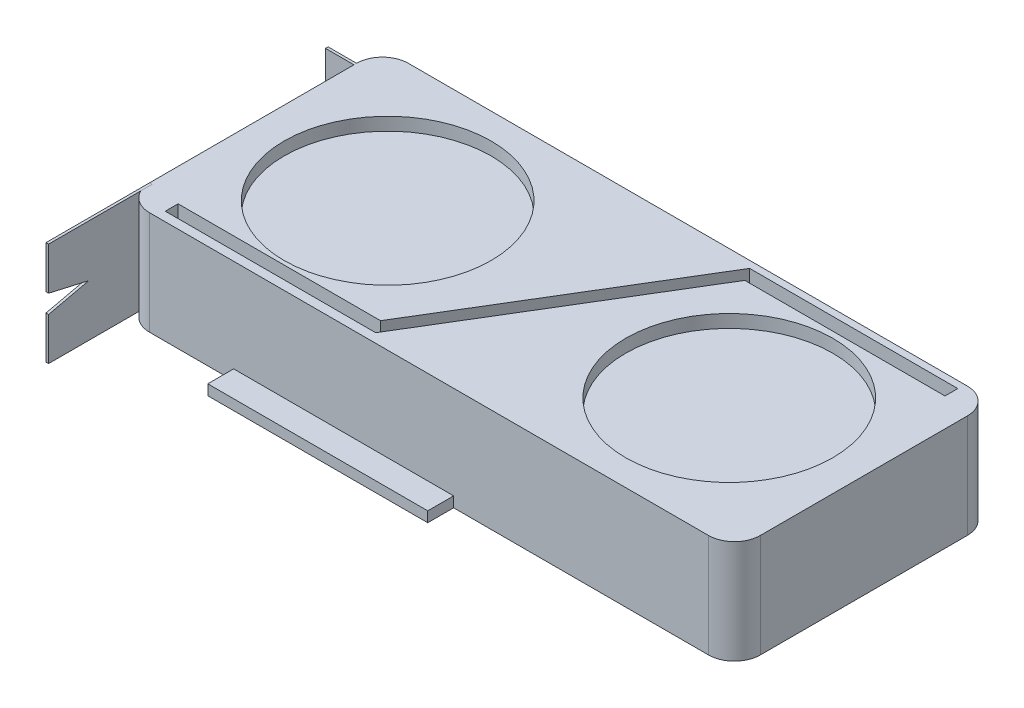
ISO-10303-21;
HEADER;
FILE_DESCRIPTION(('STEP AP214'),'2;1');
FILE_NAME('part.step','',(''),(''),'','','');
FILE_SCHEMA(('AUTOMOTIVE_DESIGN { 1 0 10303 214 1 1 1 1 }'));
ENDSEC;
DATA;
#1=APPLICATION_CONTEXT('core data for automotive mechanical design processes');
#2=APPLICATION_PROTOCOL_DEFINITION('international standard','automotive_design',2000,#1);
#3=PRODUCT_CONTEXT('',#1,'mechanical');
#4=PRODUCT('Part','Part','',(#3));
#5=PRODUCT_RELATED_PRODUCT_CATEGORY('part','',(#4));
#6=PRODUCT_DEFINITION_FORMATION('','',#4);
#7=PRODUCT_DEFINITION_CONTEXT('part definition',#1,'design');
#8=PRODUCT_DEFINITION('design','',#6,#7);
#9=PRODUCT_DEFINITION_SHAPE('','',#8);
#10=(LENGTH_UNIT() NAMED_UNIT(*) SI_UNIT(.MILLI.,.METRE.));
#11=(NAMED_UNIT(*) PLANE_ANGLE_UNIT() SI_UNIT($,.RADIAN.));
#12=(NAMED_UNIT(*) SI_UNIT($,.STERADIAN.) SOLID_ANGLE_UNIT());
#13=UNCERTAINTY_MEASURE_WITH_UNIT(LENGTH_MEASURE(1.E-05),#10,'distance_accuracy_value','');
#14=(GEOMETRIC_REPRESENTATION_CONTEXT(3) GLOBAL_UNCERTAINTY_ASSIGNED_CONTEXT((#13)) GLOBAL_UNIT_ASSIGNED_CONTEXT((#10,
#11,#12)) REPRESENTATION_CONTEXT('',''));
#15=CARTESIAN_POINT('',(0.,0.,0.));
#16=DIRECTION('',(0.,0.,1.));
#17=DIRECTION('',(1.,0.,0.));
#18=AXIS2_PLACEMENT_3D('',#15,#16,#17);
#19=CARTESIAN_POINT('',(-117.,40.,40.));
#20=DIRECTION('',(0.,0.,-1.));
#21=DIRECTION('',(-1.,0.,0.));
#22=AXIS2_PLACEMENT_3D('',#19,#20,#21);
#23=PLANE('',#22);
#24=DIRECTION('',(0.,-1.,0.));
#25=VECTOR('',#24,1.);
#26=CARTESIAN_POINT('',(-118.,40.,40.));
#27=LINE('',#26,#25);
#28=CARTESIAN_POINT('',(-118.,40.,40.));
#29=VERTEX_POINT('',#28);
#30=CARTESIAN_POINT('',(-118.,0.,40.));
#31=VERTEX_POINT('',#30);
#32=EDGE_CURVE('E144',#29,#31,#27,.T.);
#33=ORIENTED_EDGE('',*,*,#32,.F.);
#34=DIRECTION('',(-1.,0.,0.));
#35=VECTOR('',#34,1.);
#36=CARTESIAN_POINT('',(-117.,40.,40.));
#37=LINE('',#36,#35);
#38=CARTESIAN_POINT('',(-117.,40.,40.));
#39=VERTEX_POINT('',#38);
#40=EDGE_CURVE('E12',#39,#29,#37,.T.);
#41=ORIENTED_EDGE('',*,*,#40,.F.);
#42=DIRECTION('',(0.,-1.,0.));
#43=VECTOR('',#42,1.);
#44=CARTESIAN_POINT('',(-117.,40.,40.));
#45=LINE('',#44,#43);
#46=CARTESIAN_POINT('',(-117.,0.,40.));
#47=VERTEX_POINT('',#46);
#48=EDGE_CURVE('E161',#39,#47,#45,.T.);
#49=ORIENTED_EDGE('',*,*,#48,.T.);
#50=DIRECTION('',(-1.,0.,0.));
#51=VECTOR('',#50,1.);
#52=CARTESIAN_POINT('',(-117.,0.,40.));
#53=LINE('',#52,#51);
#54=EDGE_CURVE('E56',#47,#31,#53,.T.);
#55=ORIENTED_EDGE('',*,*,#54,.T.);
#56=EDGE_LOOP('',(#33,#41,#49,#55));
#57=FACE_BOUND('',#56,.T.);
#58=ADVANCED_FACE('F53',(#57),#23,.T.);
#59=CARTESIAN_POINT('',(-117.,40.,40.));
#60=DIRECTION('',(0.,1.,0.));
#61=DIRECTION('',(0.,0.,1.));
#62=AXIS2_PLACEMENT_3D('',#59,#60,#61);
#63=PLANE('',#62);
#64=DIRECTION('',(0.,0.,-1.));
#65=VECTOR('',#64,1.);
#66=CARTESIAN_POINT('',(-118.,40.,40.));
#67=LINE('',#66,#65);
#68=CARTESIAN_POINT('',(-118.,40.,80.));
#69=VERTEX_POINT('',#68);
#70=EDGE_CURVE('E159',#69,#29,#67,.T.);
#71=ORIENTED_EDGE('',*,*,#70,.F.);
#72=DIRECTION('',(-1.,0.,0.));
#73=VECTOR('',#72,1.);
#74=CARTESIAN_POINT('',(-117.,40.,80.));
#75=LINE('',#74,#73);
#76=CARTESIAN_POINT('',(-117.,40.,80.));
#77=VERTEX_POINT('',#76);
#78=EDGE_CURVE('E62',#77,#69,#75,.T.);
#79=ORIENTED_EDGE('',*,*,#78,.F.);
#80=DIRECTION('',(0.,0.,-1.));
#81=VECTOR('',#80,1.);
#82=CARTESIAN_POINT('',(-117.,40.,40.));
#83=LINE('',#82,#81);
#84=EDGE_CURVE('E134',#77,#39,#83,.T.);
#85=ORIENTED_EDGE('',*,*,#84,.T.);
#86=ORIENTED_EDGE('',*,*,#40,.T.);
#87=EDGE_LOOP('',(#71,#79,#85,#86));
#88=FACE_BOUND('',#87,.T.);
#89=ADVANCED_FACE('F171',(#88),#63,.T.);
#90=CARTESIAN_POINT('',(-117.,40.,80.));
#91=DIRECTION('',(0.,0.,1.));
#92=DIRECTION('',(1.,0.,0.));
#93=AXIS2_PLACEMENT_3D('',#90,#91,#92);
#94=PLANE('',#93);
#95=DIRECTION('',(0.,1.,0.));
#96=VECTOR('',#95,1.);
#97=CARTESIAN_POINT('',(-118.,40.,80.));
#98=LINE('',#97,#96);
#99=CARTESIAN_POINT('',(-118.,23.5437675618981,80.));
#100=VERTEX_POINT('',#99);
#101=EDGE_CURVE('E121',#100,#69,#98,.T.);
#102=ORIENTED_EDGE('',*,*,#101,.F.);
#103=DIRECTION('',(-1.,0.,0.));
#104=VECTOR('',#103,1.);
#105=CARTESIAN_POINT('',(-117.,23.5437675618981,80.));
#106=LINE('',#105,#104);
#107=CARTESIAN_POINT('',(-117.,23.5437675618981,80.));
#108=VERTEX_POINT('',#107);
#109=EDGE_CURVE('E116',#108,#100,#106,.T.);
#110=ORIENTED_EDGE('',*,*,#109,.F.);
#111=DIRECTION('',(0.,1.,0.));
#112=VECTOR('',#111,1.);
#113=CARTESIAN_POINT('',(-117.,40.,80.));
#114=LINE('',#113,#112);
#115=EDGE_CURVE('E119',#108,#77,#114,.T.);
#116=ORIENTED_EDGE('',*,*,#115,.T.);
#117=ORIENTED_EDGE('',*,*,#78,.T.);
#118=EDGE_LOOP('',(#102,#110,#116,#117));
#119=FACE_BOUND('',#118,.T.);
#120=ADVANCED_FACE('F118',(#119),#94,.T.);
#121=CARTESIAN_POINT('',(-117.,23.5437675618981,80.));
#122=DIRECTION('',(0.,-0.97495584306695,0.22239852533147));
#123=DIRECTION('',(0.,-0.22239852533147,-0.97495584306695));
#124=AXIS2_PLACEMENT_3D('',#121,#122,#123);
#125=PLANE('',#124);
#126=DIRECTION('',(0.,0.22239852533147,0.97495584306695));
#127=VECTOR('',#126,1.);
#128=CARTESIAN_POINT('',(-118.,23.5437675618981,80.));
#129=LINE('',#128,#127);
#130=CARTESIAN_POINT('',(-118.,20.,64.4647490994188));
#131=VERTEX_POINT('',#130);
#132=EDGE_CURVE('E156',#131,#100,#129,.T.);
#133=ORIENTED_EDGE('',*,*,#132,.F.);
#134=DIRECTION('',(-1.,0.,0.));
#135=VECTOR('',#134,1.);
#136=CARTESIAN_POINT('',(-117.,20.,64.4647490994188));
#137=LINE('',#136,#135);
#138=CARTESIAN_POINT('',(-117.,20.,64.4647490994188));
#139=VERTEX_POINT('',#138);
#140=EDGE_CURVE('E126',#139,#131,#137,.T.);
#141=ORIENTED_EDGE('',*,*,#140,.F.);
#142=DIRECTION('',(0.,0.22239852533147,0.97495584306695));
#143=VECTOR('',#142,1.);
#144=CARTESIAN_POINT('',(-117.,23.5437675618981,80.));
#145=LINE('',#144,#143);
#146=EDGE_CURVE('E132',#139,#108,#145,.T.);
#147=ORIENTED_EDGE('',*,*,#146,.T.);
#148=ORIENTED_EDGE('',*,*,#109,.T.);
#149=EDGE_LOOP('',(#133,#141,#147,#148));
#150=FACE_BOUND('',#149,.T.);
#151=ADVANCED_FACE('F136',(#150),#125,.T.);
#152=CARTESIAN_POINT('',(-117.,16.4562324381019,80.));
#153=DIRECTION('',(0.,0.97495584306695,0.22239852533147));
#154=DIRECTION('',(0.,-0.22239852533147,0.97495584306695));
#155=AXIS2_PLACEMENT_3D('',#152,#153,#154);
#156=PLANE('',#155);
#157=DIRECTION('',(0.,0.22239852533147,-0.97495584306695));
#158=VECTOR('',#157,1.);
#159=CARTESIAN_POINT('',(-118.,16.4562324381019,80.));
#160=LINE('',#159,#158);
#161=CARTESIAN_POINT('',(-118.,16.4562324381019,80.));
#162=VERTEX_POINT('',#161);
#163=EDGE_CURVE('E153',#162,#131,#160,.T.);
#164=ORIENTED_EDGE('',*,*,#163,.F.);
#165=DIRECTION('',(-1.,0.,0.));
#166=VECTOR('',#165,1.);
#167=CARTESIAN_POINT('',(-117.,16.4562324381019,80.));
#168=LINE('',#167,#166);
#169=CARTESIAN_POINT('',(-117.,16.4562324381019,80.));
#170=VERTEX_POINT('',#169);
#171=EDGE_CURVE('E165',#170,#162,#168,.T.);
#172=ORIENTED_EDGE('',*,*,#171,.F.);
#173=DIRECTION('',(0.,0.22239852533147,-0.97495584306695));
#174=VECTOR('',#173,1.);
#175=CARTESIAN_POINT('',(-117.,16.4562324381019,80.));
#176=LINE('',#175,#174);
#177=EDGE_CURVE('E137',#170,#139,#176,.T.);
#178=ORIENTED_EDGE('',*,*,#177,.T.);
#179=ORIENTED_EDGE('',*,*,#140,.T.);
#180=EDGE_LOOP('',(#164,#172,#178,#179));
#181=FACE_BOUND('',#180,.T.);
#182=ADVANCED_FACE('F184',(#181),#156,.T.);
#183=CARTESIAN_POINT('',(-117.,0.,80.));
#184=DIRECTION('',(0.,0.,1.));
#185=DIRECTION('',(1.,0.,0.));
#186=AXIS2_PLACEMENT_3D('',#183,#184,#185);
#187=PLANE('',#186);
#188=DIRECTION('',(0.,1.,0.));
#189=VECTOR('',#188,1.);
#190=CARTESIAN_POINT('',(-118.,0.,80.));
#191=LINE('',#190,#189);
#192=CARTESIAN_POINT('',(-118.,0.,80.));
#193=VERTEX_POINT('',#192);
#194=EDGE_CURVE('E150',#193,#162,#191,.T.);
#195=ORIENTED_EDGE('',*,*,#194,.F.);
#196=DIRECTION('',(-1.,0.,0.));
#197=VECTOR('',#196,1.);
#198=CARTESIAN_POINT('',(-117.,0.,80.));
#199=LINE('',#198,#197);
#200=CARTESIAN_POINT('',(-117.,0.,80.));
#201=VERTEX_POINT('',#200);
#202=EDGE_CURVE('E166',#201,#193,#199,.T.);
#203=ORIENTED_EDGE('',*,*,#202,.F.);
#204=DIRECTION('',(0.,1.,0.));
#205=VECTOR('',#204,1.);
#206=CARTESIAN_POINT('',(-117.,0.,80.));
#207=LINE('',#206,#205);
#208=EDGE_CURVE('E139',#201,#170,#207,.T.);
#209=ORIENTED_EDGE('',*,*,#208,.T.);
#210=ORIENTED_EDGE('',*,*,#171,.T.);
#211=EDGE_LOOP('',(#195,#203,#209,#210));
#212=FACE_BOUND('',#211,.T.);
#213=ADVANCED_FACE('F187',(#212),#187,.T.);
#214=CARTESIAN_POINT('',(-117.,0.,40.));
#215=DIRECTION('',(0.,-1.,0.));
#216=DIRECTION('',(0.,0.,-1.));
#217=AXIS2_PLACEMENT_3D('',#214,#215,#216);
#218=PLANE('',#217);
#219=DIRECTION('',(0.,0.,1.));
#220=VECTOR('',#219,1.);
#221=CARTESIAN_POINT('',(-118.,0.,40.));
#222=LINE('',#221,#220);
#223=EDGE_CURVE('E147',#31,#193,#222,.T.);
#224=ORIENTED_EDGE('',*,*,#223,.F.);
#225=ORIENTED_EDGE('',*,*,#54,.F.);
#226=DIRECTION('',(0.,0.,1.));
#227=VECTOR('',#226,1.);
#228=CARTESIAN_POINT('',(-117.,0.,40.));
#229=LINE('',#228,#227);
#230=EDGE_CURVE('E267',#47,#201,#229,.T.);
#231=ORIENTED_EDGE('',*,*,#230,.T.);
#232=ORIENTED_EDGE('',*,*,#202,.T.);
#233=EDGE_LOOP('',(#224,#225,#231,#232));
#234=FACE_BOUND('',#233,.T.);
#235=ADVANCED_FACE('F168',(#234),#218,.T.);
#236=CARTESIAN_POINT('',(-117.,0.,0.));
#237=DIRECTION('',(-1.,0.,0.));
#238=DIRECTION('',(0.,0.,1.));
#239=AXIS2_PLACEMENT_3D('',#236,#237,#238);
#240=PLANE('',#239);
#241=ORIENTED_EDGE('',*,*,#48,.F.);
#242=ORIENTED_EDGE('',*,*,#84,.F.);
#243=ORIENTED_EDGE('',*,*,#115,.F.);
#244=ORIENTED_EDGE('',*,*,#146,.F.);
#245=ORIENTED_EDGE('',*,*,#177,.F.);
#246=ORIENTED_EDGE('',*,*,#208,.F.);
#247=ORIENTED_EDGE('',*,*,#230,.F.);
#248=EDGE_LOOP('',(#241,#242,#243,#244,#245,#246,#247));
#249=FACE_BOUND('',#248,.T.);
#250=ADVANCED_FACE('F130',(#249),#240,.F.);
#251=CARTESIAN_POINT('',(-118.,0.,0.));
#252=DIRECTION('',(-1.,0.,0.));
#253=DIRECTION('',(0.,0.,1.));
#254=AXIS2_PLACEMENT_3D('',#251,#252,#253);
#255=PLANE('',#254);
#256=ORIENTED_EDGE('',*,*,#32,.T.);
#257=ORIENTED_EDGE('',*,*,#223,.T.);
#258=ORIENTED_EDGE('',*,*,#194,.T.);
#259=ORIENTED_EDGE('',*,*,#163,.T.);
#260=ORIENTED_EDGE('',*,*,#132,.T.);
#261=ORIENTED_EDGE('',*,*,#101,.T.);
#262=ORIENTED_EDGE('',*,*,#70,.T.);
#263=EDGE_LOOP('',(#256,#257,#258,#259,#260,#261,#262));
#264=FACE_BOUND('',#263,.T.);
#265=ADVANCED_FACE('F170',(#264),#255,.T.);
#266=CLOSED_SHELL('',(#58,#89,#120,#151,#182,#213,#235,#250,#265));
#267=MANIFOLD_SOLID_BREP('B2',#266);
#268=CARTESIAN_POINT('',(-118.,40.,-50.));
#269=DIRECTION('',(1.,0.,0.));
#270=DIRECTION('',(0.,0.,-1.));
#271=AXIS2_PLACEMENT_3D('',#268,#269,#270);
#272=PLANE('',#271);
#273=DIRECTION('',(0.,1.,0.));
#274=VECTOR('',#273,1.);
#275=CARTESIAN_POINT('',(-118.,40.,-39.));
#276=LINE('',#275,#274);
#277=CARTESIAN_POINT('',(-118.,0.,-39.));
#278=VERTEX_POINT('',#277);
#279=CARTESIAN_POINT('',(-118.,40.,-39.));
#280=VERTEX_POINT('',#279);
#281=EDGE_CURVE('E292',#278,#280,#276,.T.);
#282=ORIENTED_EDGE('',*,*,#281,.F.);
#283=DIRECTION('',(0.,0.,1.));
#284=VECTOR('',#283,1.);
#285=CARTESIAN_POINT('',(-118.,0.,-50.));
#286=LINE('',#285,#284);
#287=CARTESIAN_POINT('',(-118.,0.,40.));
#288=VERTEX_POINT('',#287);
#289=EDGE_CURVE('E628',#278,#288,#286,.T.);
#290=ORIENTED_EDGE('',*,*,#289,.T.);
#291=DIRECTION('',(0.,-1.,0.));
#292=VECTOR('',#291,1.);
#293=CARTESIAN_POINT('',(-118.,40.,40.));
#294=LINE('',#293,#292);
#295=CARTESIAN_POINT('',(-118.,40.,40.));
#296=VERTEX_POINT('',#295);
#297=EDGE_CURVE('E51',#288,#296,#294,.F.);
#298=ORIENTED_EDGE('',*,*,#297,.T.);
#299=DIRECTION('',(0.,0.,1.));
#300=VECTOR('',#299,1.);
#301=CARTESIAN_POINT('',(-118.,40.,-50.));
#302=LINE('',#301,#300);
#303=EDGE_CURVE('E288',#280,#296,#302,.T.);
#304=ORIENTED_EDGE('',*,*,#303,.F.);
#305=EDGE_LOOP('',(#282,#290,#298,#304));
#306=FACE_BOUND('',#305,.T.);
#307=ADVANCED_FACE('F273',(#306),#272,.F.);
#308=CARTESIAN_POINT('',(-118.,40.,50.));
#309=DIRECTION('',(0.,0.,-1.));
#310=DIRECTION('',(-1.,0.,0.));
#311=AXIS2_PLACEMENT_3D('',#308,#309,#310);
#312=PLANE('',#311);
#313=DIRECTION('',(0.,-1.,0.));
#314=VECTOR('',#313,1.);
#315=CARTESIAN_POINT('',(-75.5,0.,50.));
#316=LINE('',#315,#314);
#317=CARTESIAN_POINT('',(-75.5,4.,50.));
#318=VERTEX_POINT('',#317);
#319=CARTESIAN_POINT('',(-75.5,0.,50.));
#320=VERTEX_POINT('',#319);
#321=EDGE_CURVE('E453',#318,#320,#316,.T.);
#322=ORIENTED_EDGE('',*,*,#321,.F.);
#323=DIRECTION('',(-1.,0.,0.));
#324=VECTOR('',#323,1.);
#325=CARTESIAN_POINT('',(-75.5,4.,50.));
#326=LINE('',#325,#324);
#327=CARTESIAN_POINT('',(9.50000000000002,3.99999999999999,50.));
#328=VERTEX_POINT('',#327);
#329=EDGE_CURVE('E469',#328,#318,#326,.T.);
#330=ORIENTED_EDGE('',*,*,#329,.F.);
#331=DIRECTION('',(0.,1.,0.));
#332=VECTOR('',#331,1.);
#333=CARTESIAN_POINT('',(9.50000000000002,0.,50.));
#334=LINE('',#333,#332);
#335=CARTESIAN_POINT('',(9.50000000000002,0.,50.));
#336=VERTEX_POINT('',#335);
#337=EDGE_CURVE('E458',#336,#328,#334,.T.);
#338=ORIENTED_EDGE('',*,*,#337,.F.);
#339=DIRECTION('',(1.,0.,0.));
#340=VECTOR('',#339,1.);
#341=CARTESIAN_POINT('',(-118.,0.,50.));
#342=LINE('',#341,#340);
#343=CARTESIAN_POINT('',(108.,0.,50.));
#344=VERTEX_POINT('',#343);
#345=EDGE_CURVE('E631',#336,#344,#342,.T.);
#346=ORIENTED_EDGE('',*,*,#345,.T.);
#347=DIRECTION('',(0.,-1.,0.));
#348=VECTOR('',#347,1.);
#349=CARTESIAN_POINT('',(108.,40.,50.));
#350=LINE('',#349,#348);
#351=CARTESIAN_POINT('',(108.,40.,50.));
#352=VERTEX_POINT('',#351);
#353=EDGE_CURVE('E658',#344,#352,#350,.F.);
#354=ORIENTED_EDGE('',*,*,#353,.T.);
#355=DIRECTION('',(1.,0.,0.));
#356=VECTOR('',#355,1.);
#357=CARTESIAN_POINT('',(-118.,40.,50.));
#358=LINE('',#357,#356);
#359=CARTESIAN_POINT('',(-108.,40.,50.));
#360=VERTEX_POINT('',#359);
#361=EDGE_CURVE('E616',#360,#352,#358,.T.);
#362=ORIENTED_EDGE('',*,*,#361,.F.);
#363=DIRECTION('',(0.,-1.,0.));
#364=VECTOR('',#363,1.);
#365=CARTESIAN_POINT('',(-108.,40.,50.));
#366=LINE('',#365,#364);
#367=CARTESIAN_POINT('',(-108.,0.,50.));
#368=VERTEX_POINT('',#367);
#369=EDGE_CURVE('E654',#360,#368,#366,.T.);
#370=ORIENTED_EDGE('',*,*,#369,.T.);
#371=EDGE_CURVE('E610',#368,#320,#342,.T.);
#372=ORIENTED_EDGE('',*,*,#371,.T.);
#373=EDGE_LOOP('',(#322,#330,#338,#346,#354,#362,#370,#372));
#374=FACE_BOUND('',#373,.T.);
#375=ADVANCED_FACE('F683',(#374),#312,.F.);
#376=CARTESIAN_POINT('',(118.,40.,-50.));
#377=DIRECTION('',(-1.,0.,0.));
#378=DIRECTION('',(0.,0.,1.));
#379=AXIS2_PLACEMENT_3D('',#376,#377,#378);
#380=PLANE('',#379);
#381=DIRECTION('',(0.,0.,-1.));
#382=VECTOR('',#381,1.);
#383=CARTESIAN_POINT('',(118.,40.,-50.));
#384=LINE('',#383,#382);
#385=CARTESIAN_POINT('',(118.,40.,40.));
#386=VERTEX_POINT('',#385);
#387=CARTESIAN_POINT('',(118.,40.,-40.));
#388=VERTEX_POINT('',#387);
#389=EDGE_CURVE('E605',#386,#388,#384,.T.);
#390=ORIENTED_EDGE('',*,*,#389,.F.);
#391=DIRECTION('',(0.,-1.,0.));
#392=VECTOR('',#391,1.);
#393=CARTESIAN_POINT('',(118.,40.,40.));
#394=LINE('',#393,#392);
#395=CARTESIAN_POINT('',(118.,0.,40.));
#396=VERTEX_POINT('',#395);
#397=EDGE_CURVE('E636',#386,#396,#394,.T.);
#398=ORIENTED_EDGE('',*,*,#397,.T.);
#399=DIRECTION('',(0.,0.,-1.));
#400=VECTOR('',#399,1.);
#401=CARTESIAN_POINT('',(118.,0.,-50.));
#402=LINE('',#401,#400);
#403=CARTESIAN_POINT('',(118.,0.,-40.));
#404=VERTEX_POINT('',#403);
#405=EDGE_CURVE('E593',#396,#404,#402,.T.);
#406=ORIENTED_EDGE('',*,*,#405,.T.);
#407=DIRECTION('',(0.,-1.,0.));
#408=VECTOR('',#407,1.);
#409=CARTESIAN_POINT('',(118.,40.,-40.));
#410=LINE('',#409,#408);
#411=EDGE_CURVE('E620',#404,#388,#410,.F.);
#412=ORIENTED_EDGE('',*,*,#411,.T.);
#413=EDGE_LOOP('',(#390,#398,#406,#412));
#414=FACE_BOUND('',#413,.T.);
#415=ADVANCED_FACE('F696',(#414),#380,.F.);
#416=CARTESIAN_POINT('',(-118.,40.,-50.));
#417=DIRECTION('',(0.,0.,1.));
#418=DIRECTION('',(1.,0.,0.));
#419=AXIS2_PLACEMENT_3D('',#416,#417,#418);
#420=PLANE('',#419);
#421=DIRECTION('',(-1.,0.,0.));
#422=VECTOR('',#421,1.);
#423=CARTESIAN_POINT('',(-118.,40.,-50.));
#424=LINE('',#423,#422);
#425=CARTESIAN_POINT('',(108.,40.,-50.));
#426=VERTEX_POINT('',#425);
#427=CARTESIAN_POINT('',(-108.,40.,-50.));
#428=VERTEX_POINT('',#427);
#429=EDGE_CURVE('E609',#426,#428,#424,.T.);
#430=ORIENTED_EDGE('',*,*,#429,.F.);
#431=DIRECTION('',(0.,-1.,0.));
#432=VECTOR('',#431,1.);
#433=CARTESIAN_POINT('',(108.,40.,-50.));
#434=LINE('',#433,#432);
#435=CARTESIAN_POINT('',(108.,0.,-50.));
#436=VERTEX_POINT('',#435);
#437=EDGE_CURVE('E676',#426,#436,#434,.T.);
#438=ORIENTED_EDGE('',*,*,#437,.T.);
#439=DIRECTION('',(-1.,0.,0.));
#440=VECTOR('',#439,1.);
#441=CARTESIAN_POINT('',(-118.,0.,-50.));
#442=LINE('',#441,#440);
#443=CARTESIAN_POINT('',(-108.,0.,-50.));
#444=VERTEX_POINT('',#443);
#445=EDGE_CURVE('E624',#436,#444,#442,.T.);
#446=ORIENTED_EDGE('',*,*,#445,.T.);
#447=DIRECTION('',(0.,-1.,0.));
#448=VECTOR('',#447,1.);
#449=CARTESIAN_POINT('',(-108.,40.,-50.));
#450=LINE('',#449,#448);
#451=EDGE_CURVE('E673',#444,#428,#450,.F.);
#452=ORIENTED_EDGE('',*,*,#451,.T.);
#453=EDGE_LOOP('',(#430,#438,#446,#452));
#454=FACE_BOUND('',#453,.T.);
#455=ADVANCED_FACE('F704',(#454),#420,.F.);
#456=CARTESIAN_POINT('',(0.,40.,0.));
#457=DIRECTION('',(0.,1.,0.));
#458=DIRECTION('',(0.,0.,1.));
#459=AXIS2_PLACEMENT_3D('',#456,#457,#458);
#460=PLANE('',#459);
#461=DIRECTION('',(-1.,0.,0.));
#462=VECTOR('',#461,1.);
#463=CARTESIAN_POINT('',(-27.241082437276,40.,41.5020879765395));
#464=LINE('',#463,#462);
#465=CARTESIAN_POINT('',(-27.241082437276,40.,41.5020879765395));
#466=VERTEX_POINT('',#465);
#467=CARTESIAN_POINT('',(-105.463124796351,40.,41.5020879765395));
#468=VERTEX_POINT('',#467);
#469=EDGE_CURVE('E500',#466,#468,#464,.T.);
#470=ORIENTED_EDGE('',*,*,#469,.F.);
#471=DIRECTION('',(-0.518119437098327,0.,0.855308277114698));
#472=VECTOR('',#471,1.);
#473=CARTESIAN_POINT('',(26.5579204952753,40.,-47.3089644835453));
#474=LINE('',#473,#472);
#475=CARTESIAN_POINT('',(26.5579204952753,40.,-47.3089644835453));
#476=VERTEX_POINT('',#475);
#477=EDGE_CURVE('E506',#476,#466,#474,.T.);
#478=ORIENTED_EDGE('',*,*,#477,.F.);
#479=DIRECTION('',(-1.,0.,0.));
#480=VECTOR('',#479,1.);
#481=CARTESIAN_POINT('',(107.000239165852,40.,-47.3089644835453));
#482=LINE('',#481,#480);
#483=CARTESIAN_POINT('',(107.000239165852,40.,-47.3089644835453));
#484=VERTEX_POINT('',#483);
#485=EDGE_CURVE('E557',#484,#476,#482,.T.);
#486=ORIENTED_EDGE('',*,*,#485,.F.);
#487=DIRECTION('',(0.,0.,-1.));
#488=VECTOR('',#487,1.);
#489=CARTESIAN_POINT('',(107.000239165852,40.,-42.3560404040405));
#490=LINE('',#489,#488);
#491=CARTESIAN_POINT('',(107.000239165852,40.,-42.3560404040405));
#492=VERTEX_POINT('',#491);
#493=EDGE_CURVE('E553',#492,#484,#490,.T.);
#494=ORIENTED_EDGE('',*,*,#493,.F.);
#495=DIRECTION('',(1.,0.,0.));
#496=VECTOR('',#495,1.);
#497=CARTESIAN_POINT('',(29.6600669097927,40.,-42.3560404040405));
#498=LINE('',#497,#496);
#499=CARTESIAN_POINT('',(29.6600669097927,40.,-42.3560404040405));
#500=VERTEX_POINT('',#499);
#501=EDGE_CURVE('E549',#500,#492,#498,.T.);
#502=ORIENTED_EDGE('',*,*,#501,.F.);
#503=DIRECTION('',(0.518119437098327,0.,-0.855308277114698));
#504=VECTOR('',#503,1.);
#505=CARTESIAN_POINT('',(-24.1389360227586,40.,46.4550120560442));
#506=LINE('',#505,#504);
#507=CARTESIAN_POINT('',(-24.1389360227586,40.,46.4550120560442));
#508=VERTEX_POINT('',#507);
#509=EDGE_CURVE('E545',#508,#500,#506,.T.);
#510=ORIENTED_EDGE('',*,*,#509,.F.);
#511=DIRECTION('',(1.,0.,0.));
#512=VECTOR('',#511,1.);
#513=CARTESIAN_POINT('',(-105.463124796351,40.,46.4550120560442));
#514=LINE('',#513,#512);
#515=CARTESIAN_POINT('',(-105.463124796351,40.,46.4550120560442));
#516=VERTEX_POINT('',#515);
#517=EDGE_CURVE('E541',#516,#508,#514,.T.);
#518=ORIENTED_EDGE('',*,*,#517,.F.);
#519=DIRECTION('',(0.,0.,1.));
#520=VECTOR('',#519,1.);
#521=CARTESIAN_POINT('',(-105.463124796351,40.,41.5020879765395));
#522=LINE('',#521,#520);
#523=EDGE_CURVE('E537',#468,#516,#522,.T.);
#524=ORIENTED_EDGE('',*,*,#523,.F.);
#525=EDGE_LOOP('',(#470,#478,#486,#494,#502,#510,#518,#524));
#526=FACE_BOUND('',#525,.T.);
#527=CARTESIAN_POINT('',(-66.,40.,0.));
#528=DIRECTION('',(0.,1.,0.));
#529=DIRECTION('',(0.,0.,1.));
#530=AXIS2_PLACEMENT_3D('',#527,#528,#529);
#531=CIRCLE('',#530,40.);
#532=CARTESIAN_POINT('',(-66.,40.,40.));
#533=VERTEX_POINT('',#532);
#534=EDGE_CURVE('E594',#533,#533,#531,.T.);
#535=ORIENTED_EDGE('',*,*,#534,.F.);
#536=EDGE_LOOP('',(#535));
#537=FACE_BOUND('',#536,.T.);
#538=CARTESIAN_POINT('',(66.,40.,0.));
#539=DIRECTION('',(0.,1.,0.));
#540=DIRECTION('',(0.,0.,1.));
#541=AXIS2_PLACEMENT_3D('',#538,#539,#540);
#542=CIRCLE('',#541,40.);
#543=CARTESIAN_POINT('',(66.,40.,40.));
#544=VERTEX_POINT('',#543);
#545=EDGE_CURVE('E567',#544,#544,#542,.T.);
#546=ORIENTED_EDGE('',*,*,#545,.F.);
#547=EDGE_LOOP('',(#546));
#548=FACE_BOUND('',#547,.T.);
#549=ORIENTED_EDGE('',*,*,#361,.T.);
#550=CARTESIAN_POINT('',(108.,40.,40.));
#551=DIRECTION('',(0.,1.,0.));
#552=DIRECTION('',(0.,0.,1.));
#553=AXIS2_PLACEMENT_3D('',#550,#551,#552);
#554=CIRCLE('',#553,10.);
#555=EDGE_CURVE('E670',#352,#386,#554,.T.);
#556=ORIENTED_EDGE('',*,*,#555,.T.);
#557=ORIENTED_EDGE('',*,*,#389,.T.);
#558=CARTESIAN_POINT('',(108.,40.,-40.));
#559=DIRECTION('',(0.,1.,0.));
#560=DIRECTION('',(0.,0.,1.));
#561=AXIS2_PLACEMENT_3D('',#558,#559,#560);
#562=CIRCLE('',#561,10.);
#563=EDGE_CURVE('E667',#388,#426,#562,.T.);
#564=ORIENTED_EDGE('',*,*,#563,.T.);
#565=ORIENTED_EDGE('',*,*,#429,.T.);
#566=CARTESIAN_POINT('',(-108.,40.,-40.));
#567=DIRECTION('',(0.,1.,0.));
#568=DIRECTION('',(0.,0.,1.));
#569=AXIS2_PLACEMENT_3D('',#566,#567,#568);
#570=CIRCLE('',#569,10.);
#571=CARTESIAN_POINT('',(-118.,40.,-40.));
#572=VERTEX_POINT('',#571);
#573=EDGE_CURVE('E661',#428,#572,#570,.T.);
#574=ORIENTED_EDGE('',*,*,#573,.T.);
#575=DIRECTION('',(1.,0.,0.));
#576=VECTOR('',#575,1.);
#577=CARTESIAN_POINT('',(-129.,40.,-40.));
#578=LINE('',#577,#576);
#579=CARTESIAN_POINT('',(-129.,40.,-40.));
#580=VERTEX_POINT('',#579);
#581=EDGE_CURVE('E708',#580,#572,#578,.T.);
#582=ORIENTED_EDGE('',*,*,#581,.F.);
#583=DIRECTION('',(0.,0.,-1.));
#584=VECTOR('',#583,1.);
#585=CARTESIAN_POINT('',(-129.,40.,-40.));
#586=LINE('',#585,#584);
#587=CARTESIAN_POINT('',(-129.,40.,-39.));
#588=VERTEX_POINT('',#587);
#589=EDGE_CURVE('E444',#588,#580,#586,.T.);
#590=ORIENTED_EDGE('',*,*,#589,.F.);
#591=DIRECTION('',(1.,0.,0.));
#592=VECTOR('',#591,1.);
#593=CARTESIAN_POINT('',(-129.,40.,-39.));
#594=LINE('',#593,#592);
#595=EDGE_CURVE('E460',#588,#280,#594,.T.);
#596=ORIENTED_EDGE('',*,*,#595,.T.);
#597=ORIENTED_EDGE('',*,*,#303,.T.);
#598=CARTESIAN_POINT('',(-108.,40.,40.));
#599=DIRECTION('',(0.,1.,0.));
#600=DIRECTION('',(0.,0.,1.));
#601=AXIS2_PLACEMENT_3D('',#598,#599,#600);
#602=CIRCLE('',#601,10.);
#603=EDGE_CURVE('E664',#296,#360,#602,.T.);
#604=ORIENTED_EDGE('',*,*,#603,.T.);
#605=EDGE_LOOP('',(#549,#556,#557,#564,#565,#574,#582,#590,#596,#597,#604));
#606=FACE_BOUND('',#605,.T.);
#607=ADVANCED_FACE('F693',(#526,#537,#548,#606),#460,.T.);
#608=CARTESIAN_POINT('',(0.,0.,0.));
#609=DIRECTION('',(0.,1.,0.));
#610=DIRECTION('',(0.,0.,1.));
#611=AXIS2_PLACEMENT_3D('',#608,#609,#610);
#612=PLANE('',#611);
#613=ORIENTED_EDGE('',*,*,#405,.F.);
#614=CARTESIAN_POINT('',(108.,0.,40.));
#615=DIRECTION('',(0.,1.,0.));
#616=DIRECTION('',(0.,0.,1.));
#617=AXIS2_PLACEMENT_3D('',#614,#615,#616);
#618=CIRCLE('',#617,10.);
#619=EDGE_CURVE('E650',#396,#344,#618,.F.);
#620=ORIENTED_EDGE('',*,*,#619,.T.);
#621=ORIENTED_EDGE('',*,*,#345,.F.);
#622=DIRECTION('',(0.,0.,-1.));
#623=VECTOR('',#622,1.);
#624=CARTESIAN_POINT('',(9.50000000000002,0.,60.));
#625=LINE('',#624,#623);
#626=CARTESIAN_POINT('',(9.50000000000002,0.,60.));
#627=VERTEX_POINT('',#626);
#628=EDGE_CURVE('E492',#627,#336,#625,.T.);
#629=ORIENTED_EDGE('',*,*,#628,.F.);
#630=DIRECTION('',(1.,0.,0.));
#631=VECTOR('',#630,1.);
#632=CARTESIAN_POINT('',(-75.5,0.,60.));
#633=LINE('',#632,#631);
#634=CARTESIAN_POINT('',(-75.5,0.,60.));
#635=VERTEX_POINT('',#634);
#636=EDGE_CURVE('E468',#635,#627,#633,.T.);
#637=ORIENTED_EDGE('',*,*,#636,.F.);
#638=DIRECTION('',(0.,0.,-1.));
#639=VECTOR('',#638,1.);
#640=CARTESIAN_POINT('',(-75.5,0.,60.));
#641=LINE('',#640,#639);
#642=EDGE_CURVE('E496',#635,#320,#641,.T.);
#643=ORIENTED_EDGE('',*,*,#642,.T.);
#644=ORIENTED_EDGE('',*,*,#371,.F.);
#645=CARTESIAN_POINT('',(-108.,0.,40.));
#646=DIRECTION('',(0.,1.,0.));
#647=DIRECTION('',(0.,0.,1.));
#648=AXIS2_PLACEMENT_3D('',#645,#646,#647);
#649=CIRCLE('',#648,10.);
#650=EDGE_CURVE('E643',#368,#288,#649,.F.);
#651=ORIENTED_EDGE('',*,*,#650,.T.);
#652=ORIENTED_EDGE('',*,*,#289,.F.);
#653=DIRECTION('',(1.,0.,0.));
#654=VECTOR('',#653,1.);
#655=CARTESIAN_POINT('',(-129.,0.,-39.));
#656=LINE('',#655,#654);
#657=CARTESIAN_POINT('',(-129.,0.,-39.));
#658=VERTEX_POINT('',#657);
#659=EDGE_CURVE('E434',#658,#278,#656,.T.);
#660=ORIENTED_EDGE('',*,*,#659,.F.);
#661=DIRECTION('',(0.,0.,1.));
#662=VECTOR('',#661,1.);
#663=CARTESIAN_POINT('',(-129.,0.,-40.));
#664=LINE('',#663,#662);
#665=CARTESIAN_POINT('',(-129.,0.,-40.));
#666=VERTEX_POINT('',#665);
#667=EDGE_CURVE('E426',#666,#658,#664,.T.);
#668=ORIENTED_EDGE('',*,*,#667,.F.);
#669=DIRECTION('',(1.,0.,0.));
#670=VECTOR('',#669,1.);
#671=CARTESIAN_POINT('',(-129.,0.,-40.));
#672=LINE('',#671,#670);
#673=CARTESIAN_POINT('',(-118.,0.,-40.));
#674=VERTEX_POINT('',#673);
#675=EDGE_CURVE('E431',#666,#674,#672,.T.);
#676=ORIENTED_EDGE('',*,*,#675,.T.);
#677=CARTESIAN_POINT('',(-108.,0.,-40.));
#678=DIRECTION('',(0.,1.,0.));
#679=DIRECTION('',(0.,0.,1.));
#680=AXIS2_PLACEMENT_3D('',#677,#678,#679);
#681=CIRCLE('',#680,10.);
#682=EDGE_CURVE('E640',#674,#444,#681,.F.);
#683=ORIENTED_EDGE('',*,*,#682,.T.);
#684=ORIENTED_EDGE('',*,*,#445,.F.);
#685=CARTESIAN_POINT('',(108.,0.,-40.));
#686=DIRECTION('',(0.,1.,0.));
#687=DIRECTION('',(0.,0.,1.));
#688=AXIS2_PLACEMENT_3D('',#685,#686,#687);
#689=CIRCLE('',#688,10.);
#690=EDGE_CURVE('E647',#436,#404,#689,.F.);
#691=ORIENTED_EDGE('',*,*,#690,.T.);
#692=EDGE_LOOP('',(#613,#620,#621,#629,#637,#643,#644,#651,#652,#660,#668,#676,#683,#684,#691));
#693=FACE_BOUND('',#692,.T.);
#694=ADVANCED_FACE('F429',(#693),#612,.F.);
#695=CARTESIAN_POINT('',(66.,35.,0.));
#696=DIRECTION('',(0.,1.,0.));
#697=DIRECTION('',(0.,0.,1.));
#698=AXIS2_PLACEMENT_3D('',#695,#696,#697);
#699=CYLINDRICAL_SURFACE('',#698,40.);
#700=CARTESIAN_POINT('',(66.,35.,0.));
#701=DIRECTION('',(0.,1.,0.));
#702=DIRECTION('',(0.,0.,1.));
#703=AXIS2_PLACEMENT_3D('',#700,#701,#702);
#704=CIRCLE('',#703,40.);
#705=CARTESIAN_POINT('',(66.,35.,40.));
#706=VERTEX_POINT('',#705);
#707=EDGE_CURVE('E598',#706,#706,#704,.T.);
#708=ORIENTED_EDGE('',*,*,#707,.F.);
#709=EDGE_LOOP('',(#708));
#710=FACE_BOUND('',#709,.T.);
#711=ORIENTED_EDGE('',*,*,#545,.T.);
#712=EDGE_LOOP('',(#711));
#713=FACE_BOUND('',#712,.T.);
#714=ADVANCED_FACE('F801',(#710,#713),#699,.F.);
#715=CARTESIAN_POINT('',(0.,35.,0.));
#716=DIRECTION('',(0.,1.,0.));
#717=DIRECTION('',(0.,0.,1.));
#718=AXIS2_PLACEMENT_3D('',#715,#716,#717);
#719=PLANE('',#718);
#720=ORIENTED_EDGE('',*,*,#707,.T.);
#721=EDGE_LOOP('',(#720));
#722=FACE_BOUND('',#721,.T.);
#723=ADVANCED_FACE('F797',(#722),#719,.T.);
#724=CARTESIAN_POINT('',(-66.,35.,0.));
#725=DIRECTION('',(0.,1.,0.));
#726=DIRECTION('',(0.,0.,1.));
#727=AXIS2_PLACEMENT_3D('',#724,#725,#726);
#728=CYLINDRICAL_SURFACE('',#727,40.);
#729=CARTESIAN_POINT('',(-66.,35.,0.));
#730=DIRECTION('',(0.,1.,0.));
#731=DIRECTION('',(0.,0.,1.));
#732=AXIS2_PLACEMENT_3D('',#729,#730,#731);
#733=CIRCLE('',#732,40.);
#734=CARTESIAN_POINT('',(-66.,35.,40.));
#735=VERTEX_POINT('',#734);
#736=EDGE_CURVE('E589',#735,#735,#733,.T.);
#737=ORIENTED_EDGE('',*,*,#736,.F.);
#738=EDGE_LOOP('',(#737));
#739=FACE_BOUND('',#738,.T.);
#740=ORIENTED_EDGE('',*,*,#534,.T.);
#741=EDGE_LOOP('',(#740));
#742=FACE_BOUND('',#741,.T.);
#743=ADVANCED_FACE('F793',(#739,#742),#728,.F.);
#744=CARTESIAN_POINT('',(0.,35.,0.));
#745=DIRECTION('',(0.,1.,0.));
#746=DIRECTION('',(0.,0.,1.));
#747=AXIS2_PLACEMENT_3D('',#744,#745,#746);
#748=PLANE('',#747);
#749=ORIENTED_EDGE('',*,*,#736,.T.);
#750=EDGE_LOOP('',(#749));
#751=FACE_BOUND('',#750,.T.);
#752=ADVANCED_FACE('F765',(#751),#748,.T.);
#753=CARTESIAN_POINT('',(108.,40.,40.));
#754=DIRECTION('',(0.,-1.,0.));
#755=DIRECTION('',(0.,0.,-1.));
#756=AXIS2_PLACEMENT_3D('',#753,#754,#755);
#757=CYLINDRICAL_SURFACE('',#756,10.);
#758=ORIENTED_EDGE('',*,*,#555,.F.);
#759=ORIENTED_EDGE('',*,*,#353,.F.);
#760=ORIENTED_EDGE('',*,*,#619,.F.);
#761=ORIENTED_EDGE('',*,*,#397,.F.);
#762=EDGE_LOOP('',(#758,#759,#760,#761));
#763=FACE_BOUND('',#762,.T.);
#764=ADVANCED_FACE('F690',(#763),#757,.T.);
#765=CARTESIAN_POINT('',(108.,40.,-40.));
#766=DIRECTION('',(0.,-1.,0.));
#767=DIRECTION('',(0.,0.,-1.));
#768=AXIS2_PLACEMENT_3D('',#765,#766,#767);
#769=CYLINDRICAL_SURFACE('',#768,10.);
#770=ORIENTED_EDGE('',*,*,#563,.F.);
#771=ORIENTED_EDGE('',*,*,#411,.F.);
#772=ORIENTED_EDGE('',*,*,#690,.F.);
#773=ORIENTED_EDGE('',*,*,#437,.F.);
#774=EDGE_LOOP('',(#770,#771,#772,#773));
#775=FACE_BOUND('',#774,.T.);
#776=ADVANCED_FACE('F699',(#775),#769,.T.);
#777=CARTESIAN_POINT('',(-108.,40.,40.));
#778=DIRECTION('',(0.,-1.,0.));
#779=DIRECTION('',(0.,0.,-1.));
#780=AXIS2_PLACEMENT_3D('',#777,#778,#779);
#781=CYLINDRICAL_SURFACE('',#780,10.);
#782=ORIENTED_EDGE('',*,*,#603,.F.);
#783=ORIENTED_EDGE('',*,*,#297,.F.);
#784=ORIENTED_EDGE('',*,*,#650,.F.);
#785=ORIENTED_EDGE('',*,*,#369,.F.);
#786=EDGE_LOOP('',(#782,#783,#784,#785));
#787=FACE_BOUND('',#786,.T.);
#788=ADVANCED_FACE('F726',(#787),#781,.T.);
#789=CARTESIAN_POINT('',(-108.,40.,-40.));
#790=DIRECTION('',(0.,-1.,0.));
#791=DIRECTION('',(0.,0.,-1.));
#792=AXIS2_PLACEMENT_3D('',#789,#790,#791);
#793=CYLINDRICAL_SURFACE('',#792,10.);
#794=ORIENTED_EDGE('',*,*,#573,.F.);
#795=ORIENTED_EDGE('',*,*,#451,.F.);
#796=ORIENTED_EDGE('',*,*,#682,.F.);
#797=DIRECTION('',(0.,-1.,0.));
#798=VECTOR('',#797,1.);
#799=CARTESIAN_POINT('',(-118.,40.,-40.));
#800=LINE('',#799,#798);
#801=EDGE_CURVE('E282',#572,#674,#800,.T.);
#802=ORIENTED_EDGE('',*,*,#801,.F.);
#803=EDGE_LOOP('',(#794,#795,#796,#802));
#804=FACE_BOUND('',#803,.T.);
#805=ADVANCED_FACE('F275',(#804),#793,.T.);
#806=CARTESIAN_POINT('',(-27.241082437276,30.,41.5020879765395));
#807=DIRECTION('',(0.,0.,-1.));
#808=DIRECTION('',(-1.,0.,0.));
#809=AXIS2_PLACEMENT_3D('',#806,#807,#808);
#810=PLANE('',#809);
#811=ORIENTED_EDGE('',*,*,#469,.T.);
#812=DIRECTION('',(0.,1.,0.));
#813=VECTOR('',#812,1.);
#814=CARTESIAN_POINT('',(-105.463124796351,30.,41.5020879765395));
#815=LINE('',#814,#813);
#816=CARTESIAN_POINT('',(-105.463124796351,30.,41.5020879765395));
#817=VERTEX_POINT('',#816);
#818=EDGE_CURVE('E534',#817,#468,#815,.T.);
#819=ORIENTED_EDGE('',*,*,#818,.F.);
#820=DIRECTION('',(-1.,0.,0.));
#821=VECTOR('',#820,1.);
#822=CARTESIAN_POINT('',(-27.241082437276,30.,41.5020879765395));
#823=LINE('',#822,#821);
#824=CARTESIAN_POINT('',(-27.241082437276,30.,41.5020879765395));
#825=VERTEX_POINT('',#824);
#826=EDGE_CURVE('E501',#825,#817,#823,.T.);
#827=ORIENTED_EDGE('',*,*,#826,.F.);
#828=DIRECTION('',(0.,1.,0.));
#829=VECTOR('',#828,1.);
#830=CARTESIAN_POINT('',(-27.241082437276,30.,41.5020879765395));
#831=LINE('',#830,#829);
#832=EDGE_CURVE('E564',#825,#466,#831,.T.);
#833=ORIENTED_EDGE('',*,*,#832,.T.);
#834=EDGE_LOOP('',(#811,#819,#827,#833));
#835=FACE_BOUND('',#834,.T.);
#836=ADVANCED_FACE('F772',(#835),#810,.F.);
#837=CARTESIAN_POINT('',(26.5579204952753,30.,-47.3089644835453));
#838=DIRECTION('',(-0.855308277114698,0.,-0.518119437098327));
#839=DIRECTION('',(-0.518119437098327,0.,0.855308277114698));
#840=AXIS2_PLACEMENT_3D('',#837,#838,#839);
#841=PLANE('',#840);
#842=ORIENTED_EDGE('',*,*,#477,.T.);
#843=ORIENTED_EDGE('',*,*,#832,.F.);
#844=DIRECTION('',(-0.518119437098327,0.,0.855308277114698));
#845=VECTOR('',#844,1.);
#846=CARTESIAN_POINT('',(26.5579204952753,30.,-47.3089644835453));
#847=LINE('',#846,#845);
#848=CARTESIAN_POINT('',(26.5579204952753,30.,-47.3089644835453));
#849=VERTEX_POINT('',#848);
#850=EDGE_CURVE('E530',#849,#825,#847,.T.);
#851=ORIENTED_EDGE('',*,*,#850,.F.);
#852=DIRECTION('',(0.,1.,0.));
#853=VECTOR('',#852,1.);
#854=CARTESIAN_POINT('',(26.5579204952753,30.,-47.3089644835453));
#855=LINE('',#854,#853);
#856=EDGE_CURVE('E568',#849,#476,#855,.T.);
#857=ORIENTED_EDGE('',*,*,#856,.T.);
#858=EDGE_LOOP('',(#842,#843,#851,#857));
#859=FACE_BOUND('',#858,.T.);
#860=ADVANCED_FACE('F777',(#859),#841,.F.);
#861=CARTESIAN_POINT('',(107.000239165852,30.,-47.3089644835453));
#862=DIRECTION('',(0.,0.,-1.));
#863=DIRECTION('',(-1.,0.,0.));
#864=AXIS2_PLACEMENT_3D('',#861,#862,#863);
#865=PLANE('',#864);
#866=ORIENTED_EDGE('',*,*,#485,.T.);
#867=ORIENTED_EDGE('',*,*,#856,.F.);
#868=DIRECTION('',(-1.,0.,0.));
#869=VECTOR('',#868,1.);
#870=CARTESIAN_POINT('',(107.000239165852,30.,-47.3089644835453));
#871=LINE('',#870,#869);
#872=CARTESIAN_POINT('',(107.000239165852,30.,-47.3089644835453));
#873=VERTEX_POINT('',#872);
#874=EDGE_CURVE('E526',#873,#849,#871,.T.);
#875=ORIENTED_EDGE('',*,*,#874,.F.);
#876=DIRECTION('',(0.,1.,0.));
#877=VECTOR('',#876,1.);
#878=CARTESIAN_POINT('',(107.000239165852,30.,-47.3089644835453));
#879=LINE('',#878,#877);
#880=EDGE_CURVE('E571',#873,#484,#879,.T.);
#881=ORIENTED_EDGE('',*,*,#880,.T.);
#882=EDGE_LOOP('',(#866,#867,#875,#881));
#883=FACE_BOUND('',#882,.T.);
#884=ADVANCED_FACE('F784',(#883),#865,.F.);
#885=CARTESIAN_POINT('',(107.000239165852,30.,-42.3560404040405));
#886=DIRECTION('',(1.,0.,0.));
#887=DIRECTION('',(0.,0.,-1.));
#888=AXIS2_PLACEMENT_3D('',#885,#886,#887);
#889=PLANE('',#888);
#890=ORIENTED_EDGE('',*,*,#493,.T.);
#891=ORIENTED_EDGE('',*,*,#880,.F.);
#892=DIRECTION('',(0.,0.,-1.));
#893=VECTOR('',#892,1.);
#894=CARTESIAN_POINT('',(107.000239165852,30.,-42.3560404040405));
#895=LINE('',#894,#893);
#896=CARTESIAN_POINT('',(107.000239165852,30.,-42.3560404040405));
#897=VERTEX_POINT('',#896);
#898=EDGE_CURVE('E522',#897,#873,#895,.T.);
#899=ORIENTED_EDGE('',*,*,#898,.F.);
#900=DIRECTION('',(0.,1.,0.));
#901=VECTOR('',#900,1.);
#902=CARTESIAN_POINT('',(107.000239165852,30.,-42.3560404040405));
#903=LINE('',#902,#901);
#904=EDGE_CURVE('E574',#897,#492,#903,.T.);
#905=ORIENTED_EDGE('',*,*,#904,.T.);
#906=EDGE_LOOP('',(#890,#891,#899,#905));
#907=FACE_BOUND('',#906,.T.);
#908=ADVANCED_FACE('F859',(#907),#889,.F.);
#909=CARTESIAN_POINT('',(29.6600669097927,30.,-42.3560404040405));
#910=DIRECTION('',(0.,0.,1.));
#911=DIRECTION('',(1.,0.,0.));
#912=AXIS2_PLACEMENT_3D('',#909,#910,#911);
#913=PLANE('',#912);
#914=ORIENTED_EDGE('',*,*,#501,.T.);
#915=ORIENTED_EDGE('',*,*,#904,.F.);
#916=DIRECTION('',(1.,0.,0.));
#917=VECTOR('',#916,1.);
#918=CARTESIAN_POINT('',(29.6600669097927,30.,-42.3560404040405));
#919=LINE('',#918,#917);
#920=CARTESIAN_POINT('',(29.6600669097927,30.,-42.3560404040405));
#921=VERTEX_POINT('',#920);
#922=EDGE_CURVE('E518',#921,#897,#919,.T.);
#923=ORIENTED_EDGE('',*,*,#922,.F.);
#924=DIRECTION('',(0.,1.,0.));
#925=VECTOR('',#924,1.);
#926=CARTESIAN_POINT('',(29.6600669097927,30.,-42.3560404040405));
#927=LINE('',#926,#925);
#928=EDGE_CURVE('E577',#921,#500,#927,.T.);
#929=ORIENTED_EDGE('',*,*,#928,.T.);
#930=EDGE_LOOP('',(#914,#915,#923,#929));
#931=FACE_BOUND('',#930,.T.);
#932=ADVANCED_FACE('F870',(#931),#913,.F.);
#933=CARTESIAN_POINT('',(-24.1389360227586,30.,46.4550120560442));
#934=DIRECTION('',(0.855308277114698,0.,0.518119437098327));
#935=DIRECTION('',(0.518119437098327,0.,-0.855308277114698));
#936=AXIS2_PLACEMENT_3D('',#933,#934,#935);
#937=PLANE('',#936);
#938=ORIENTED_EDGE('',*,*,#509,.T.);
#939=ORIENTED_EDGE('',*,*,#928,.F.);
#940=DIRECTION('',(0.518119437098327,0.,-0.855308277114698));
#941=VECTOR('',#940,1.);
#942=CARTESIAN_POINT('',(-24.1389360227586,30.,46.4550120560442));
#943=LINE('',#942,#941);
#944=CARTESIAN_POINT('',(-24.1389360227586,30.,46.4550120560442));
#945=VERTEX_POINT('',#944);
#946=EDGE_CURVE('E514',#945,#921,#943,.T.);
#947=ORIENTED_EDGE('',*,*,#946,.F.);
#948=DIRECTION('',(0.,1.,0.));
#949=VECTOR('',#948,1.);
#950=CARTESIAN_POINT('',(-24.1389360227586,30.,46.4550120560442));
#951=LINE('',#950,#949);
#952=EDGE_CURVE('E580',#945,#508,#951,.T.);
#953=ORIENTED_EDGE('',*,*,#952,.T.);
#954=EDGE_LOOP('',(#938,#939,#947,#953));
#955=FACE_BOUND('',#954,.T.);
#956=ADVANCED_FACE('F881',(#955),#937,.F.);
#957=CARTESIAN_POINT('',(-105.463124796351,30.,46.4550120560442));
#958=DIRECTION('',(0.,0.,1.));
#959=DIRECTION('',(1.,0.,0.));
#960=AXIS2_PLACEMENT_3D('',#957,#958,#959);
#961=PLANE('',#960);
#962=ORIENTED_EDGE('',*,*,#517,.T.);
#963=ORIENTED_EDGE('',*,*,#952,.F.);
#964=DIRECTION('',(1.,0.,0.));
#965=VECTOR('',#964,1.);
#966=CARTESIAN_POINT('',(-105.463124796351,30.,46.4550120560442));
#967=LINE('',#966,#965);
#968=CARTESIAN_POINT('',(-105.463124796351,30.,46.4550120560442));
#969=VERTEX_POINT('',#968);
#970=EDGE_CURVE('E510',#969,#945,#967,.T.);
#971=ORIENTED_EDGE('',*,*,#970,.F.);
#972=DIRECTION('',(0.,1.,0.));
#973=VECTOR('',#972,1.);
#974=CARTESIAN_POINT('',(-105.463124796351,30.,46.4550120560442));
#975=LINE('',#974,#973);
#976=EDGE_CURVE('E583',#969,#516,#975,.T.);
#977=ORIENTED_EDGE('',*,*,#976,.T.);
#978=EDGE_LOOP('',(#962,#963,#971,#977));
#979=FACE_BOUND('',#978,.T.);
#980=ADVANCED_FACE('F892',(#979),#961,.F.);
#981=CARTESIAN_POINT('',(-105.463124796351,30.,41.5020879765395));
#982=DIRECTION('',(-1.,0.,0.));
#983=DIRECTION('',(0.,0.,1.));
#984=AXIS2_PLACEMENT_3D('',#981,#982,#983);
#985=PLANE('',#984);
#986=ORIENTED_EDGE('',*,*,#523,.T.);
#987=ORIENTED_EDGE('',*,*,#976,.F.);
#988=DIRECTION('',(0.,0.,1.));
#989=VECTOR('',#988,1.);
#990=CARTESIAN_POINT('',(-105.463124796351,30.,41.5020879765395));
#991=LINE('',#990,#989);
#992=EDGE_CURVE('E505',#817,#969,#991,.T.);
#993=ORIENTED_EDGE('',*,*,#992,.F.);
#994=ORIENTED_EDGE('',*,*,#818,.T.);
#995=EDGE_LOOP('',(#986,#987,#993,#994));
#996=FACE_BOUND('',#995,.T.);
#997=ADVANCED_FACE('F789',(#996),#985,.F.);
#998=CARTESIAN_POINT('',(0.,30.,0.));
#999=DIRECTION('',(0.,1.,0.));
#1000=DIRECTION('',(0.,0.,1.));
#1001=AXIS2_PLACEMENT_3D('',#998,#999,#1000);
#1002=PLANE('',#1001);
#1003=ORIENTED_EDGE('',*,*,#826,.T.);
#1004=ORIENTED_EDGE('',*,*,#992,.T.);
#1005=ORIENTED_EDGE('',*,*,#970,.T.);
#1006=ORIENTED_EDGE('',*,*,#946,.T.);
#1007=ORIENTED_EDGE('',*,*,#922,.T.);
#1008=ORIENTED_EDGE('',*,*,#898,.T.);
#1009=ORIENTED_EDGE('',*,*,#874,.T.);
#1010=ORIENTED_EDGE('',*,*,#850,.T.);
#1011=EDGE_LOOP('',(#1003,#1004,#1005,#1006,#1007,#1008,#1009,#1010));
#1012=FACE_BOUND('',#1011,.T.);
#1013=ADVANCED_FACE('F911',(#1012),#1002,.T.);
#1014=CARTESIAN_POINT('',(-75.5,0.,60.));
#1015=DIRECTION('',(1.,0.,0.));
#1016=DIRECTION('',(0.,0.,-1.));
#1017=AXIS2_PLACEMENT_3D('',#1014,#1015,#1016);
#1018=PLANE('',#1017);
#1019=ORIENTED_EDGE('',*,*,#321,.T.);
#1020=ORIENTED_EDGE('',*,*,#642,.F.);
#1021=DIRECTION('',(0.,-1.,0.));
#1022=VECTOR('',#1021,1.);
#1023=CARTESIAN_POINT('',(-75.5,0.,60.));
#1024=LINE('',#1023,#1022);
#1025=CARTESIAN_POINT('',(-75.5,4.,60.));
#1026=VERTEX_POINT('',#1025);
#1027=EDGE_CURVE('E464',#1026,#635,#1024,.T.);
#1028=ORIENTED_EDGE('',*,*,#1027,.F.);
#1029=DIRECTION('',(0.,0.,-1.));
#1030=VECTOR('',#1029,1.);
#1031=CARTESIAN_POINT('',(-75.5,4.,60.));
#1032=LINE('',#1031,#1030);
#1033=EDGE_CURVE('E477',#1026,#318,#1032,.T.);
#1034=ORIENTED_EDGE('',*,*,#1033,.T.);
#1035=EDGE_LOOP('',(#1019,#1020,#1028,#1034));
#1036=FACE_BOUND('',#1035,.T.);
#1037=ADVANCED_FACE('F731',(#1036),#1018,.F.);
#1038=CARTESIAN_POINT('',(9.50000000000002,0.,60.));
#1039=DIRECTION('',(-1.,0.,0.));
#1040=DIRECTION('',(0.,0.,1.));
#1041=AXIS2_PLACEMENT_3D('',#1038,#1039,#1040);
#1042=PLANE('',#1041);
#1043=ORIENTED_EDGE('',*,*,#337,.T.);
#1044=DIRECTION('',(0.,0.,-1.));
#1045=VECTOR('',#1044,1.);
#1046=CARTESIAN_POINT('',(9.50000000000002,4.,60.));
#1047=LINE('',#1046,#1045);
#1048=CARTESIAN_POINT('',(9.50000000000002,4.,60.));
#1049=VERTEX_POINT('',#1048);
#1050=EDGE_CURVE('E488',#1049,#328,#1047,.T.);
#1051=ORIENTED_EDGE('',*,*,#1050,.F.);
#1052=DIRECTION('',(0.,1.,0.));
#1053=VECTOR('',#1052,1.);
#1054=CARTESIAN_POINT('',(9.50000000000002,0.,60.));
#1055=LINE('',#1054,#1053);
#1056=EDGE_CURVE('E472',#627,#1049,#1055,.T.);
#1057=ORIENTED_EDGE('',*,*,#1056,.F.);
#1058=ORIENTED_EDGE('',*,*,#628,.T.);
#1059=EDGE_LOOP('',(#1043,#1051,#1057,#1058));
#1060=FACE_BOUND('',#1059,.T.);
#1061=ADVANCED_FACE('F739',(#1060),#1042,.F.);
#1062=CARTESIAN_POINT('',(-75.5,4.,60.));
#1063=DIRECTION('',(0.,-1.,0.));
#1064=DIRECTION('',(1.,0.,0.));
#1065=AXIS2_PLACEMENT_3D('',#1062,#1063,#1064);
#1066=PLANE('',#1065);
#1067=ORIENTED_EDGE('',*,*,#329,.T.);
#1068=ORIENTED_EDGE('',*,*,#1033,.F.);
#1069=DIRECTION('',(-1.,0.,0.));
#1070=VECTOR('',#1069,1.);
#1071=CARTESIAN_POINT('',(-75.5,4.,60.));
#1072=LINE('',#1071,#1070);
#1073=EDGE_CURVE('E475',#1049,#1026,#1072,.T.);
#1074=ORIENTED_EDGE('',*,*,#1073,.F.);
#1075=ORIENTED_EDGE('',*,*,#1050,.T.);
#1076=EDGE_LOOP('',(#1067,#1068,#1074,#1075));
#1077=FACE_BOUND('',#1076,.T.);
#1078=ADVANCED_FACE('F734',(#1077),#1066,.F.);
#1079=CARTESIAN_POINT('',(0.,0.,60.));
#1080=DIRECTION('',(0.,0.,-1.));
#1081=DIRECTION('',(-1.,0.,0.));
#1082=AXIS2_PLACEMENT_3D('',#1079,#1080,#1081);
#1083=PLANE('',#1082);
#1084=ORIENTED_EDGE('',*,*,#1027,.T.);
#1085=ORIENTED_EDGE('',*,*,#636,.T.);
#1086=ORIENTED_EDGE('',*,*,#1056,.T.);
#1087=ORIENTED_EDGE('',*,*,#1073,.T.);
#1088=EDGE_LOOP('',(#1084,#1085,#1086,#1087));
#1089=FACE_BOUND('',#1088,.T.);
#1090=ADVANCED_FACE('F741',(#1089),#1083,.F.);
#1091=CARTESIAN_POINT('',(-129.,40.,-40.));
#1092=DIRECTION('',(0.,0.,1.));
#1093=DIRECTION('',(1.,0.,0.));
#1094=AXIS2_PLACEMENT_3D('',#1091,#1092,#1093);
#1095=PLANE('',#1094);
#1096=ORIENTED_EDGE('',*,*,#801,.T.);
#1097=ORIENTED_EDGE('',*,*,#675,.F.);
#1098=DIRECTION('',(0.,-1.,0.));
#1099=VECTOR('',#1098,1.);
#1100=CARTESIAN_POINT('',(-129.,40.,-40.));
#1101=LINE('',#1100,#1099);
#1102=EDGE_CURVE('E439',#580,#666,#1101,.T.);
#1103=ORIENTED_EDGE('',*,*,#1102,.F.);
#1104=ORIENTED_EDGE('',*,*,#581,.T.);
#1105=EDGE_LOOP('',(#1096,#1097,#1103,#1104));
#1106=FACE_BOUND('',#1105,.T.);
#1107=ADVANCED_FACE('F450',(#1106),#1095,.F.);
#1108=CARTESIAN_POINT('',(-129.,40.,-39.));
#1109=DIRECTION('',(0.,0.,-1.));
#1110=DIRECTION('',(-1.,0.,0.));
#1111=AXIS2_PLACEMENT_3D('',#1108,#1109,#1110);
#1112=PLANE('',#1111);
#1113=ORIENTED_EDGE('',*,*,#281,.T.);
#1114=ORIENTED_EDGE('',*,*,#595,.F.);
#1115=DIRECTION('',(0.,1.,0.));
#1116=VECTOR('',#1115,1.);
#1117=CARTESIAN_POINT('',(-129.,40.,-39.));
#1118=LINE('',#1117,#1116);
#1119=EDGE_CURVE('E438',#658,#588,#1118,.T.);
#1120=ORIENTED_EDGE('',*,*,#1119,.F.);
#1121=ORIENTED_EDGE('',*,*,#659,.T.);
#1122=EDGE_LOOP('',(#1113,#1114,#1120,#1121));
#1123=FACE_BOUND('',#1122,.T.);
#1124=ADVANCED_FACE('F721',(#1123),#1112,.F.);
#1125=CARTESIAN_POINT('',(-129.,0.,0.));
#1126=DIRECTION('',(-1.,0.,0.));
#1127=DIRECTION('',(0.,0.,1.));
#1128=AXIS2_PLACEMENT_3D('',#1125,#1126,#1127);
#1129=PLANE('',#1128);
#1130=ORIENTED_EDGE('',*,*,#1102,.T.);
#1131=ORIENTED_EDGE('',*,*,#667,.T.);
#1132=ORIENTED_EDGE('',*,*,#1119,.T.);
#1133=ORIENTED_EDGE('',*,*,#589,.T.);
#1134=EDGE_LOOP('',(#1130,#1131,#1132,#1133));
#1135=FACE_BOUND('',#1134,.T.);
#1136=ADVANCED_FACE('F442',(#1135),#1129,.T.);
#1137=CLOSED_SHELL('',(#307,#375,#415,#455,#607,#694,#714,#723,#743,#752,#764,#776,#788,#805,
#836,#860,#884,#908,#932,#956,#980,#997,#1013,#1037,#1061,#1078,#1090,#1107,#1124,#1136));
#1138=MANIFOLD_SOLID_BREP('B6',#1137);
#1139=ADVANCED_BREP_SHAPE_REPRESENTATION('',(#18,#267,#1138),#14);
#1140=SHAPE_DEFINITION_REPRESENTATION(#9,#1139);
ENDSEC;
END-ISO-10303-21;
